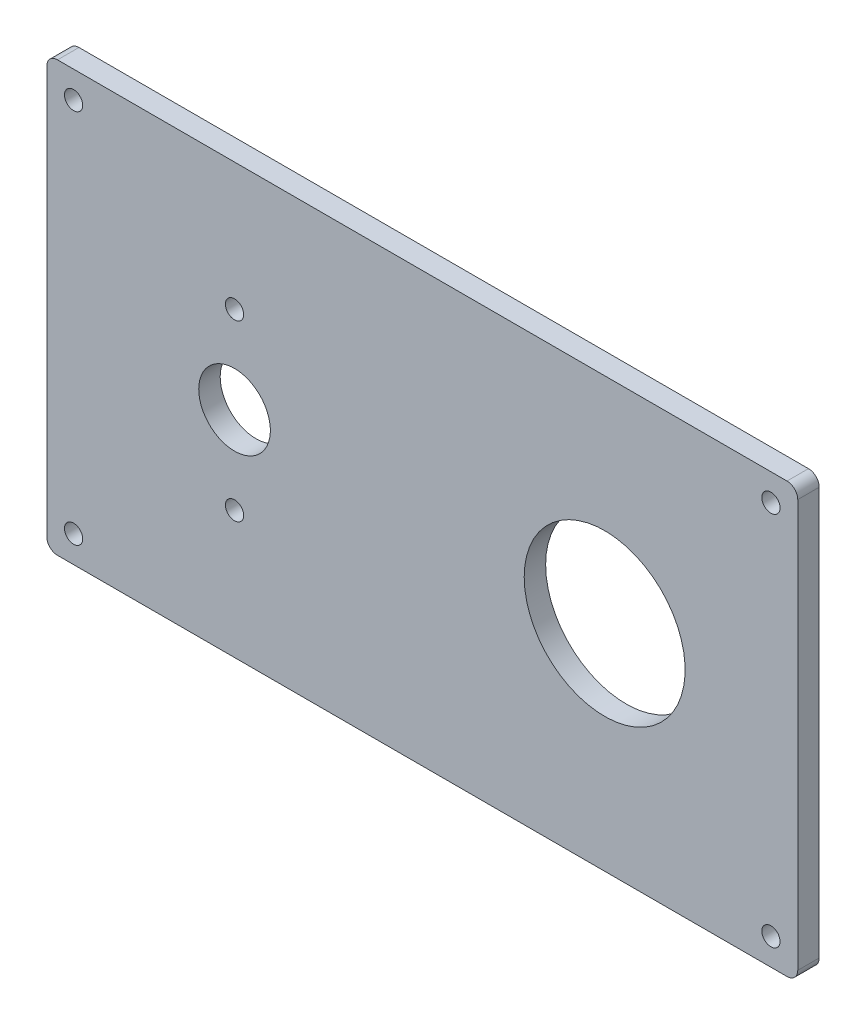
ISO-10303-21;
HEADER;
FILE_DESCRIPTION(('STEP AP214'),'2;1');
FILE_NAME('part.step','',(''),(''),'','','');
FILE_SCHEMA(('AUTOMOTIVE_DESIGN { 1 0 10303 214 1 1 1 1 }'));
ENDSEC;
DATA;
#1=APPLICATION_CONTEXT('core data for automotive mechanical design processes');
#2=APPLICATION_PROTOCOL_DEFINITION('international standard','automotive_design',2000,#1);
#3=PRODUCT_CONTEXT('',#1,'mechanical');
#4=PRODUCT('Part','Part','',(#3));
#5=PRODUCT_RELATED_PRODUCT_CATEGORY('part','',(#4));
#6=PRODUCT_DEFINITION_FORMATION('','',#4);
#7=PRODUCT_DEFINITION_CONTEXT('part definition',#1,'design');
#8=PRODUCT_DEFINITION('design','',#6,#7);
#9=PRODUCT_DEFINITION_SHAPE('','',#8);
#10=(LENGTH_UNIT() NAMED_UNIT(*) SI_UNIT(.MILLI.,.METRE.));
#11=(NAMED_UNIT(*) PLANE_ANGLE_UNIT() SI_UNIT($,.RADIAN.));
#12=(NAMED_UNIT(*) SI_UNIT($,.STERADIAN.) SOLID_ANGLE_UNIT());
#13=UNCERTAINTY_MEASURE_WITH_UNIT(LENGTH_MEASURE(1.E-05),#10,'distance_accuracy_value','');
#14=(GEOMETRIC_REPRESENTATION_CONTEXT(3) GLOBAL_UNCERTAINTY_ASSIGNED_CONTEXT((#13)) GLOBAL_UNIT_ASSIGNED_CONTEXT((#10,
#11,#12)) REPRESENTATION_CONTEXT('',''));
#15=CARTESIAN_POINT('',(0.,0.,0.));
#16=DIRECTION('',(0.,0.,1.));
#17=DIRECTION('',(1.,0.,0.));
#18=AXIS2_PLACEMENT_3D('',#15,#16,#17);
#19=CARTESIAN_POINT('',(-1.10944648153135,38.5388552235937,4.));
#20=DIRECTION('',(1.,0.,0.));
#21=DIRECTION('',(0.,1.,0.));
#22=AXIS2_PLACEMENT_3D('',#19,#20,#21);
#23=PLANE('',#22);
#24=DIRECTION('',(0.,-1.,0.));
#25=VECTOR('',#24,1.);
#26=CARTESIAN_POINT('',(-1.10944648153135,38.5388552235937,0.));
#27=LINE('',#26,#25);
#28=CARTESIAN_POINT('',(-1.10944648153135,36.5388552235937,0.));
#29=VERTEX_POINT('',#28);
#30=CARTESIAN_POINT('',(-1.10944648153134,-39.4611447764063,0.));
#31=VERTEX_POINT('',#30);
#32=EDGE_CURVE('E128',#29,#31,#27,.T.);
#33=ORIENTED_EDGE('',*,*,#32,.T.);
#34=DIRECTION('',(0.,0.,-1.));
#35=VECTOR('',#34,1.);
#36=CARTESIAN_POINT('',(-1.10944648153134,-39.4611447764063,4.));
#37=LINE('',#36,#35);
#38=CARTESIAN_POINT('',(-1.10944648153134,-39.4611447764063,4.));
#39=VERTEX_POINT('',#38);
#40=EDGE_CURVE('E151',#31,#39,#37,.F.);
#41=ORIENTED_EDGE('',*,*,#40,.T.);
#42=DIRECTION('',(0.,-1.,0.));
#43=VECTOR('',#42,1.);
#44=CARTESIAN_POINT('',(-1.10944648153135,38.5388552235937,4.));
#45=LINE('',#44,#43);
#46=CARTESIAN_POINT('',(-1.10944648153135,36.5388552235937,4.));
#47=VERTEX_POINT('',#46);
#48=EDGE_CURVE('E126',#47,#39,#45,.T.);
#49=ORIENTED_EDGE('',*,*,#48,.F.);
#50=DIRECTION('',(0.,0.,-1.));
#51=VECTOR('',#50,1.);
#52=CARTESIAN_POINT('',(-1.10944648153135,36.5388552235937,4.));
#53=LINE('',#52,#51);
#54=EDGE_CURVE('E148',#47,#29,#53,.T.);
#55=ORIENTED_EDGE('',*,*,#54,.T.);
#56=EDGE_LOOP('',(#33,#41,#49,#55));
#57=FACE_BOUND('',#56,.T.);
#58=ADVANCED_FACE('F33',(#57),#23,.F.);
#59=CARTESIAN_POINT('',(-1.10944648153134,-41.4611447764063,4.));
#60=DIRECTION('',(0.,1.,0.));
#61=DIRECTION('',(0.,0.,1.));
#62=AXIS2_PLACEMENT_3D('',#59,#60,#61);
#63=PLANE('',#62);
#64=DIRECTION('',(1.,0.,0.));
#65=VECTOR('',#64,1.);
#66=CARTESIAN_POINT('',(-1.10944648153134,-41.4611447764063,0.));
#67=LINE('',#66,#65);
#68=CARTESIAN_POINT('',(0.890553518468664,-41.4611447764063,0.));
#69=VERTEX_POINT('',#68);
#70=CARTESIAN_POINT('',(136.890553518469,-41.4611447764063,0.));
#71=VERTEX_POINT('',#70);
#72=EDGE_CURVE('E124',#69,#71,#67,.T.);
#73=ORIENTED_EDGE('',*,*,#72,.T.);
#74=DIRECTION('',(0.,0.,-1.));
#75=VECTOR('',#74,1.);
#76=CARTESIAN_POINT('',(136.890553518469,-41.4611447764063,4.));
#77=LINE('',#76,#75);
#78=CARTESIAN_POINT('',(136.890553518469,-41.4611447764063,4.));
#79=VERTEX_POINT('',#78);
#80=EDGE_CURVE('E103',#71,#79,#77,.F.);
#81=ORIENTED_EDGE('',*,*,#80,.T.);
#82=DIRECTION('',(1.,0.,0.));
#83=VECTOR('',#82,1.);
#84=CARTESIAN_POINT('',(-1.10944648153134,-41.4611447764063,4.));
#85=LINE('',#84,#83);
#86=CARTESIAN_POINT('',(0.890553518468664,-41.4611447764063,4.));
#87=VERTEX_POINT('',#86);
#88=EDGE_CURVE('E167',#87,#79,#85,.T.);
#89=ORIENTED_EDGE('',*,*,#88,.F.);
#90=DIRECTION('',(0.,0.,-1.));
#91=VECTOR('',#90,1.);
#92=CARTESIAN_POINT('',(0.890553518468664,-41.4611447764063,4.));
#93=LINE('',#92,#91);
#94=EDGE_CURVE('E108',#87,#69,#93,.T.);
#95=ORIENTED_EDGE('',*,*,#94,.T.);
#96=EDGE_LOOP('',(#73,#81,#89,#95));
#97=FACE_BOUND('',#96,.T.);
#98=ADVANCED_FACE('F259',(#97),#63,.F.);
#99=CARTESIAN_POINT('',(138.890553518469,38.5388552235937,4.));
#100=DIRECTION('',(-1.,0.,0.));
#101=DIRECTION('',(0.,0.,1.));
#102=AXIS2_PLACEMENT_3D('',#99,#100,#101);
#103=PLANE('',#102);
#104=DIRECTION('',(0.,1.,0.));
#105=VECTOR('',#104,1.);
#106=CARTESIAN_POINT('',(138.890553518469,38.5388552235937,4.));
#107=LINE('',#106,#105);
#108=CARTESIAN_POINT('',(138.890553518469,-39.4611447764063,4.));
#109=VERTEX_POINT('',#108);
#110=CARTESIAN_POINT('',(138.890553518469,36.5388552235937,4.));
#111=VERTEX_POINT('',#110);
#112=EDGE_CURVE('E117',#109,#111,#107,.T.);
#113=ORIENTED_EDGE('',*,*,#112,.F.);
#114=DIRECTION('',(0.,0.,-1.));
#115=VECTOR('',#114,1.);
#116=CARTESIAN_POINT('',(138.890553518469,-39.4611447764063,4.));
#117=LINE('',#116,#115);
#118=CARTESIAN_POINT('',(138.890553518469,-39.4611447764063,0.));
#119=VERTEX_POINT('',#118);
#120=EDGE_CURVE('E102',#109,#119,#117,.T.);
#121=ORIENTED_EDGE('',*,*,#120,.T.);
#122=DIRECTION('',(0.,1.,0.));
#123=VECTOR('',#122,1.);
#124=CARTESIAN_POINT('',(138.890553518469,38.5388552235937,0.));
#125=LINE('',#124,#123);
#126=CARTESIAN_POINT('',(138.890553518469,36.5388552235937,0.));
#127=VERTEX_POINT('',#126);
#128=EDGE_CURVE('E115',#119,#127,#125,.T.);
#129=ORIENTED_EDGE('',*,*,#128,.T.);
#130=DIRECTION('',(0.,0.,-1.));
#131=VECTOR('',#130,1.);
#132=CARTESIAN_POINT('',(138.890553518469,36.5388552235937,4.));
#133=LINE('',#132,#131);
#134=EDGE_CURVE('E119',#127,#111,#133,.F.);
#135=ORIENTED_EDGE('',*,*,#134,.T.);
#136=EDGE_LOOP('',(#113,#121,#129,#135));
#137=FACE_BOUND('',#136,.T.);
#138=ADVANCED_FACE('F114',(#137),#103,.F.);
#139=CARTESIAN_POINT('',(-1.10944648153135,38.5388552235937,4.));
#140=DIRECTION('',(0.,-1.,0.));
#141=DIRECTION('',(0.,0.,-1.));
#142=AXIS2_PLACEMENT_3D('',#139,#140,#141);
#143=PLANE('',#142);
#144=DIRECTION('',(-1.,0.,0.));
#145=VECTOR('',#144,1.);
#146=CARTESIAN_POINT('',(-1.10944648153135,38.5388552235937,0.));
#147=LINE('',#146,#145);
#148=CARTESIAN_POINT('',(136.890553518469,38.5388552235937,0.));
#149=VERTEX_POINT('',#148);
#150=CARTESIAN_POINT('',(0.890553518468655,38.5388552235937,0.));
#151=VERTEX_POINT('',#150);
#152=EDGE_CURVE('E123',#149,#151,#147,.T.);
#153=ORIENTED_EDGE('',*,*,#152,.T.);
#154=DIRECTION('',(0.,0.,-1.));
#155=VECTOR('',#154,1.);
#156=CARTESIAN_POINT('',(0.890553518468655,38.5388552235937,4.));
#157=LINE('',#156,#155);
#158=CARTESIAN_POINT('',(0.890553518468655,38.5388552235937,4.));
#159=VERTEX_POINT('',#158);
#160=EDGE_CURVE('E11',#151,#159,#157,.F.);
#161=ORIENTED_EDGE('',*,*,#160,.T.);
#162=DIRECTION('',(-1.,0.,0.));
#163=VECTOR('',#162,1.);
#164=CARTESIAN_POINT('',(-1.10944648153135,38.5388552235937,4.));
#165=LINE('',#164,#163);
#166=CARTESIAN_POINT('',(136.890553518469,38.5388552235937,4.));
#167=VERTEX_POINT('',#166);
#168=EDGE_CURVE('E132',#167,#159,#165,.T.);
#169=ORIENTED_EDGE('',*,*,#168,.F.);
#170=DIRECTION('',(0.,0.,-1.));
#171=VECTOR('',#170,1.);
#172=CARTESIAN_POINT('',(136.890553518469,38.5388552235937,4.));
#173=LINE('',#172,#171);
#174=EDGE_CURVE('E41',#167,#149,#173,.T.);
#175=ORIENTED_EDGE('',*,*,#174,.T.);
#176=EDGE_LOOP('',(#153,#161,#169,#175));
#177=FACE_BOUND('',#176,.T.);
#178=ADVANCED_FACE('F154',(#177),#143,.F.);
#179=CARTESIAN_POINT('',(0.,0.,4.));
#180=DIRECTION('',(0.,0.,1.));
#181=DIRECTION('',(1.,0.,0.));
#182=AXIS2_PLACEMENT_3D('',#179,#180,#181);
#183=PLANE('',#182);
#184=CARTESIAN_POINT('',(33.8905535184687,14.7588552235937,4.));
#185=DIRECTION('',(0.,0.,-1.));
#186=DIRECTION('',(-1.,0.,0.));
#187=AXIS2_PLACEMENT_3D('',#184,#185,#186);
#188=CIRCLE('',#187,1.7);
#189=CARTESIAN_POINT('',(32.1905535184687,14.7588552235937,4.));
#190=VERTEX_POINT('',#189);
#191=EDGE_CURVE('E181',#190,#190,#188,.T.);
#192=ORIENTED_EDGE('',*,*,#191,.T.);
#193=EDGE_LOOP('',(#192));
#194=FACE_BOUND('',#193,.T.);
#195=CARTESIAN_POINT('',(33.8905535184687,-17.6811447764063,4.));
#196=DIRECTION('',(0.,0.,-1.));
#197=DIRECTION('',(-1.,0.,0.));
#198=AXIS2_PLACEMENT_3D('',#195,#196,#197);
#199=CIRCLE('',#198,1.7);
#200=CARTESIAN_POINT('',(32.1905535184687,-17.6811447764063,4.));
#201=VERTEX_POINT('',#200);
#202=EDGE_CURVE('E199',#201,#201,#199,.T.);
#203=ORIENTED_EDGE('',*,*,#202,.T.);
#204=EDGE_LOOP('',(#203));
#205=FACE_BOUND('',#204,.T.);
#206=CARTESIAN_POINT('',(3.89055351846866,-36.4611447764063,4.));
#207=DIRECTION('',(0.,0.,-1.));
#208=DIRECTION('',(-1.,0.,0.));
#209=AXIS2_PLACEMENT_3D('',#206,#207,#208);
#210=CIRCLE('',#209,1.7);
#211=CARTESIAN_POINT('',(2.19055351846866,-36.4611447764063,4.));
#212=VERTEX_POINT('',#211);
#213=EDGE_CURVE('E193',#212,#212,#210,.T.);
#214=ORIENTED_EDGE('',*,*,#213,.T.);
#215=EDGE_LOOP('',(#214));
#216=FACE_BOUND('',#215,.T.);
#217=CARTESIAN_POINT('',(133.890553518469,-36.4611447764063,4.));
#218=DIRECTION('',(0.,0.,-1.));
#219=DIRECTION('',(-1.,0.,0.));
#220=AXIS2_PLACEMENT_3D('',#217,#218,#219);
#221=CIRCLE('',#220,1.70000000000001);
#222=CARTESIAN_POINT('',(132.190553518469,-36.4611447764063,4.));
#223=VERTEX_POINT('',#222);
#224=EDGE_CURVE('E186',#223,#223,#221,.T.);
#225=ORIENTED_EDGE('',*,*,#224,.T.);
#226=EDGE_LOOP('',(#225));
#227=FACE_BOUND('',#226,.T.);
#228=CARTESIAN_POINT('',(133.890553518469,33.5388552235937,4.));
#229=DIRECTION('',(0.,0.,-1.));
#230=DIRECTION('',(-1.,0.,0.));
#231=AXIS2_PLACEMENT_3D('',#228,#229,#230);
#232=CIRCLE('',#231,1.70000000000001);
#233=CARTESIAN_POINT('',(132.190553518469,33.5388552235937,4.));
#234=VERTEX_POINT('',#233);
#235=EDGE_CURVE('E187',#234,#234,#232,.T.);
#236=ORIENTED_EDGE('',*,*,#235,.T.);
#237=EDGE_LOOP('',(#236));
#238=FACE_BOUND('',#237,.T.);
#239=CARTESIAN_POINT('',(3.89055351846865,33.5388552235937,4.));
#240=DIRECTION('',(0.,0.,-1.));
#241=DIRECTION('',(-1.,0.,0.));
#242=AXIS2_PLACEMENT_3D('',#239,#240,#241);
#243=CIRCLE('',#242,1.70000000000002);
#244=CARTESIAN_POINT('',(2.19055351846864,33.5388552235937,4.));
#245=VERTEX_POINT('',#244);
#246=EDGE_CURVE('E216',#245,#245,#243,.T.);
#247=ORIENTED_EDGE('',*,*,#246,.T.);
#248=EDGE_LOOP('',(#247));
#249=FACE_BOUND('',#248,.T.);
#250=CARTESIAN_POINT('',(102.890553518469,-1.46114477640628,4.));
#251=DIRECTION('',(0.,0.,-1.));
#252=DIRECTION('',(-1.,0.,0.));
#253=AXIS2_PLACEMENT_3D('',#250,#251,#252);
#254=CIRCLE('',#253,15.);
#255=CARTESIAN_POINT('',(87.8905535184686,-1.46114477640628,4.));
#256=VERTEX_POINT('',#255);
#257=EDGE_CURVE('E210',#256,#256,#254,.T.);
#258=ORIENTED_EDGE('',*,*,#257,.T.);
#259=EDGE_LOOP('',(#258));
#260=FACE_BOUND('',#259,.T.);
#261=CARTESIAN_POINT('',(33.8905535184687,-1.46114477640628,4.));
#262=DIRECTION('',(0.,0.,-1.));
#263=DIRECTION('',(-1.,0.,0.));
#264=AXIS2_PLACEMENT_3D('',#261,#262,#263);
#265=CIRCLE('',#264,6.675);
#266=CARTESIAN_POINT('',(27.2155535184687,-1.46114477640628,4.));
#267=VERTEX_POINT('',#266);
#268=EDGE_CURVE('E176',#267,#267,#265,.T.);
#269=ORIENTED_EDGE('',*,*,#268,.T.);
#270=EDGE_LOOP('',(#269));
#271=FACE_BOUND('',#270,.T.);
#272=ORIENTED_EDGE('',*,*,#88,.T.);
#273=CARTESIAN_POINT('',(136.890553518469,-39.4611447764063,4.));
#274=DIRECTION('',(0.,0.,1.));
#275=DIRECTION('',(1.,0.,0.));
#276=AXIS2_PLACEMENT_3D('',#273,#274,#275);
#277=CIRCLE('',#276,2.);
#278=EDGE_CURVE('E146',#79,#109,#277,.T.);
#279=ORIENTED_EDGE('',*,*,#278,.T.);
#280=ORIENTED_EDGE('',*,*,#112,.T.);
#281=CARTESIAN_POINT('',(136.890553518469,36.5388552235937,4.));
#282=DIRECTION('',(0.,0.,1.));
#283=DIRECTION('',(1.,0.,0.));
#284=AXIS2_PLACEMENT_3D('',#281,#282,#283);
#285=CIRCLE('',#284,2.);
#286=EDGE_CURVE('E53',#111,#167,#285,.T.);
#287=ORIENTED_EDGE('',*,*,#286,.T.);
#288=ORIENTED_EDGE('',*,*,#168,.T.);
#289=CARTESIAN_POINT('',(0.890553518468655,36.5388552235937,4.));
#290=DIRECTION('',(0.,0.,1.));
#291=DIRECTION('',(1.,0.,0.));
#292=AXIS2_PLACEMENT_3D('',#289,#290,#291);
#293=CIRCLE('',#292,2.);
#294=EDGE_CURVE('E142',#159,#47,#293,.T.);
#295=ORIENTED_EDGE('',*,*,#294,.T.);
#296=ORIENTED_EDGE('',*,*,#48,.T.);
#297=CARTESIAN_POINT('',(0.890553518468664,-39.4611447764063,4.));
#298=DIRECTION('',(0.,0.,1.));
#299=DIRECTION('',(1.,0.,0.));
#300=AXIS2_PLACEMENT_3D('',#297,#298,#299);
#301=CIRCLE('',#300,2.);
#302=EDGE_CURVE('E144',#39,#87,#301,.T.);
#303=ORIENTED_EDGE('',*,*,#302,.T.);
#304=EDGE_LOOP('',(#272,#279,#280,#287,#288,#295,#296,#303));
#305=FACE_BOUND('',#304,.T.);
#306=ADVANCED_FACE('F225',(#194,#205,#216,#227,#238,#249,#260,#271,#305),#183,.T.);
#307=CARTESIAN_POINT('',(0.,0.,0.));
#308=DIRECTION('',(0.,0.,1.));
#309=DIRECTION('',(1.,0.,0.));
#310=AXIS2_PLACEMENT_3D('',#307,#308,#309);
#311=PLANE('',#310);
#312=CARTESIAN_POINT('',(33.8905535184687,14.7588552235937,0.));
#313=DIRECTION('',(0.,0.,-1.));
#314=DIRECTION('',(-1.,0.,0.));
#315=AXIS2_PLACEMENT_3D('',#312,#313,#314);
#316=CIRCLE('',#315,1.7);
#317=CARTESIAN_POINT('',(32.1905535184687,14.7588552235937,0.));
#318=VERTEX_POINT('',#317);
#319=EDGE_CURVE('E202',#318,#318,#316,.T.);
#320=ORIENTED_EDGE('',*,*,#319,.F.);
#321=EDGE_LOOP('',(#320));
#322=FACE_BOUND('',#321,.T.);
#323=CARTESIAN_POINT('',(33.8905535184687,-17.6811447764063,0.));
#324=DIRECTION('',(0.,0.,-1.));
#325=DIRECTION('',(-1.,0.,0.));
#326=AXIS2_PLACEMENT_3D('',#323,#324,#325);
#327=CIRCLE('',#326,1.7);
#328=CARTESIAN_POINT('',(32.1905535184687,-17.6811447764063,0.));
#329=VERTEX_POINT('',#328);
#330=EDGE_CURVE('E196',#329,#329,#327,.T.);
#331=ORIENTED_EDGE('',*,*,#330,.F.);
#332=EDGE_LOOP('',(#331));
#333=FACE_BOUND('',#332,.T.);
#334=CARTESIAN_POINT('',(3.89055351846866,-36.4611447764063,0.));
#335=DIRECTION('',(0.,0.,-1.));
#336=DIRECTION('',(-1.,0.,0.));
#337=AXIS2_PLACEMENT_3D('',#334,#335,#336);
#338=CIRCLE('',#337,1.7);
#339=CARTESIAN_POINT('',(2.19055351846866,-36.4611447764063,0.));
#340=VERTEX_POINT('',#339);
#341=EDGE_CURVE('E190',#340,#340,#338,.T.);
#342=ORIENTED_EDGE('',*,*,#341,.F.);
#343=EDGE_LOOP('',(#342));
#344=FACE_BOUND('',#343,.T.);
#345=CARTESIAN_POINT('',(133.890553518469,-36.4611447764063,0.));
#346=DIRECTION('',(0.,0.,-1.));
#347=DIRECTION('',(-1.,0.,0.));
#348=AXIS2_PLACEMENT_3D('',#345,#346,#347);
#349=CIRCLE('',#348,1.70000000000001);
#350=CARTESIAN_POINT('',(132.190553518469,-36.4611447764063,0.));
#351=VERTEX_POINT('',#350);
#352=EDGE_CURVE('E183',#351,#351,#349,.T.);
#353=ORIENTED_EDGE('',*,*,#352,.F.);
#354=EDGE_LOOP('',(#353));
#355=FACE_BOUND('',#354,.T.);
#356=CARTESIAN_POINT('',(133.890553518469,33.5388552235937,0.));
#357=DIRECTION('',(0.,0.,-1.));
#358=DIRECTION('',(-1.,0.,0.));
#359=AXIS2_PLACEMENT_3D('',#356,#357,#358);
#360=CIRCLE('',#359,1.70000000000001);
#361=CARTESIAN_POINT('',(132.190553518469,33.5388552235937,0.));
#362=VERTEX_POINT('',#361);
#363=EDGE_CURVE('E219',#362,#362,#360,.T.);
#364=ORIENTED_EDGE('',*,*,#363,.F.);
#365=EDGE_LOOP('',(#364));
#366=FACE_BOUND('',#365,.T.);
#367=CARTESIAN_POINT('',(3.89055351846865,33.5388552235937,0.));
#368=DIRECTION('',(0.,0.,-1.));
#369=DIRECTION('',(-1.,0.,0.));
#370=AXIS2_PLACEMENT_3D('',#367,#368,#369);
#371=CIRCLE('',#370,1.70000000000002);
#372=CARTESIAN_POINT('',(2.19055351846864,33.5388552235937,0.));
#373=VERTEX_POINT('',#372);
#374=EDGE_CURVE('E213',#373,#373,#371,.T.);
#375=ORIENTED_EDGE('',*,*,#374,.F.);
#376=EDGE_LOOP('',(#375));
#377=FACE_BOUND('',#376,.T.);
#378=CARTESIAN_POINT('',(102.890553518469,-1.46114477640628,0.));
#379=DIRECTION('',(0.,0.,-1.));
#380=DIRECTION('',(-1.,0.,0.));
#381=AXIS2_PLACEMENT_3D('',#378,#379,#380);
#382=CIRCLE('',#381,15.);
#383=CARTESIAN_POINT('',(87.8905535184686,-1.46114477640628,0.));
#384=VERTEX_POINT('',#383);
#385=EDGE_CURVE('E207',#384,#384,#382,.T.);
#386=ORIENTED_EDGE('',*,*,#385,.F.);
#387=EDGE_LOOP('',(#386));
#388=FACE_BOUND('',#387,.T.);
#389=CARTESIAN_POINT('',(33.8905535184687,-1.46114477640628,0.));
#390=DIRECTION('',(0.,0.,-1.));
#391=DIRECTION('',(-1.,0.,0.));
#392=AXIS2_PLACEMENT_3D('',#389,#390,#391);
#393=CIRCLE('',#392,6.675);
#394=CARTESIAN_POINT('',(27.2155535184687,-1.46114477640628,0.));
#395=VERTEX_POINT('',#394);
#396=EDGE_CURVE('E172',#395,#395,#393,.T.);
#397=ORIENTED_EDGE('',*,*,#396,.F.);
#398=EDGE_LOOP('',(#397));
#399=FACE_BOUND('',#398,.T.);
#400=ORIENTED_EDGE('',*,*,#128,.F.);
#401=CARTESIAN_POINT('',(136.890553518469,-39.4611447764063,0.));
#402=DIRECTION('',(0.,0.,1.));
#403=DIRECTION('',(1.,0.,0.));
#404=AXIS2_PLACEMENT_3D('',#401,#402,#403);
#405=CIRCLE('',#404,2.);
#406=EDGE_CURVE('E98',#119,#71,#405,.F.);
#407=ORIENTED_EDGE('',*,*,#406,.T.);
#408=ORIENTED_EDGE('',*,*,#72,.F.);
#409=CARTESIAN_POINT('',(0.890553518468664,-39.4611447764063,0.));
#410=DIRECTION('',(0.,0.,1.));
#411=DIRECTION('',(1.,0.,0.));
#412=AXIS2_PLACEMENT_3D('',#409,#410,#411);
#413=CIRCLE('',#412,2.);
#414=EDGE_CURVE('E109',#69,#31,#413,.F.);
#415=ORIENTED_EDGE('',*,*,#414,.T.);
#416=ORIENTED_EDGE('',*,*,#32,.F.);
#417=CARTESIAN_POINT('',(0.890553518468655,36.5388552235937,0.));
#418=DIRECTION('',(0.,0.,1.));
#419=DIRECTION('',(1.,0.,0.));
#420=AXIS2_PLACEMENT_3D('',#417,#418,#419);
#421=CIRCLE('',#420,2.);
#422=EDGE_CURVE('E135',#29,#151,#421,.F.);
#423=ORIENTED_EDGE('',*,*,#422,.T.);
#424=ORIENTED_EDGE('',*,*,#152,.F.);
#425=CARTESIAN_POINT('',(136.890553518469,36.5388552235937,0.));
#426=DIRECTION('',(0.,0.,1.));
#427=DIRECTION('',(1.,0.,0.));
#428=AXIS2_PLACEMENT_3D('',#425,#426,#427);
#429=CIRCLE('',#428,2.);
#430=EDGE_CURVE('E118',#149,#127,#429,.F.);
#431=ORIENTED_EDGE('',*,*,#430,.T.);
#432=EDGE_LOOP('',(#400,#407,#408,#415,#416,#423,#424,#431));
#433=FACE_BOUND('',#432,.T.);
#434=ADVANCED_FACE('F121',(#322,#333,#344,#355,#366,#377,#388,#399,#433),#311,.F.);
#435=CARTESIAN_POINT('',(33.8905535184687,-1.46114477640628,4.));
#436=DIRECTION('',(0.,0.,-1.));
#437=DIRECTION('',(-1.,0.,0.));
#438=AXIS2_PLACEMENT_3D('',#435,#436,#437);
#439=CYLINDRICAL_SURFACE('',#438,6.675);
#440=ORIENTED_EDGE('',*,*,#268,.F.);
#441=EDGE_LOOP('',(#440));
#442=FACE_BOUND('',#441,.T.);
#443=ORIENTED_EDGE('',*,*,#396,.T.);
#444=EDGE_LOOP('',(#443));
#445=FACE_BOUND('',#444,.T.);
#446=ADVANCED_FACE('F238',(#442,#445),#439,.F.);
#447=CARTESIAN_POINT('',(102.890553518469,-1.46114477640628,4.));
#448=DIRECTION('',(0.,0.,-1.));
#449=DIRECTION('',(-1.,0.,0.));
#450=AXIS2_PLACEMENT_3D('',#447,#448,#449);
#451=CYLINDRICAL_SURFACE('',#450,15.);
#452=ORIENTED_EDGE('',*,*,#257,.F.);
#453=EDGE_LOOP('',(#452));
#454=FACE_BOUND('',#453,.T.);
#455=ORIENTED_EDGE('',*,*,#385,.T.);
#456=EDGE_LOOP('',(#455));
#457=FACE_BOUND('',#456,.T.);
#458=ADVANCED_FACE('F248',(#454,#457),#451,.F.);
#459=CARTESIAN_POINT('',(3.89055351846865,33.5388552235937,4.));
#460=DIRECTION('',(0.,0.,-1.));
#461=DIRECTION('',(-1.,0.,0.));
#462=AXIS2_PLACEMENT_3D('',#459,#460,#461);
#463=CYLINDRICAL_SURFACE('',#462,1.70000000000002);
#464=ORIENTED_EDGE('',*,*,#246,.F.);
#465=EDGE_LOOP('',(#464));
#466=FACE_BOUND('',#465,.T.);
#467=ORIENTED_EDGE('',*,*,#374,.T.);
#468=EDGE_LOOP('',(#467));
#469=FACE_BOUND('',#468,.T.);
#470=ADVANCED_FACE('F232',(#466,#469),#463,.F.);
#471=CARTESIAN_POINT('',(133.890553518469,33.5388552235937,4.));
#472=DIRECTION('',(0.,0.,-1.));
#473=DIRECTION('',(-1.,0.,0.));
#474=AXIS2_PLACEMENT_3D('',#471,#472,#473);
#475=CYLINDRICAL_SURFACE('',#474,1.70000000000001);
#476=ORIENTED_EDGE('',*,*,#235,.F.);
#477=EDGE_LOOP('',(#476));
#478=FACE_BOUND('',#477,.T.);
#479=ORIENTED_EDGE('',*,*,#363,.T.);
#480=EDGE_LOOP('',(#479));
#481=FACE_BOUND('',#480,.T.);
#482=ADVANCED_FACE('F228',(#478,#481),#475,.F.);
#483=CARTESIAN_POINT('',(133.890553518469,-36.4611447764063,4.));
#484=DIRECTION('',(0.,0.,-1.));
#485=DIRECTION('',(-1.,0.,0.));
#486=AXIS2_PLACEMENT_3D('',#483,#484,#485);
#487=CYLINDRICAL_SURFACE('',#486,1.70000000000001);
#488=ORIENTED_EDGE('',*,*,#224,.F.);
#489=EDGE_LOOP('',(#488));
#490=FACE_BOUND('',#489,.T.);
#491=ORIENTED_EDGE('',*,*,#352,.T.);
#492=EDGE_LOOP('',(#491));
#493=FACE_BOUND('',#492,.T.);
#494=ADVANCED_FACE('F231',(#490,#493),#487,.F.);
#495=CARTESIAN_POINT('',(3.89055351846866,-36.4611447764063,4.));
#496=DIRECTION('',(0.,0.,-1.));
#497=DIRECTION('',(-1.,0.,0.));
#498=AXIS2_PLACEMENT_3D('',#495,#496,#497);
#499=CYLINDRICAL_SURFACE('',#498,1.7);
#500=ORIENTED_EDGE('',*,*,#213,.F.);
#501=EDGE_LOOP('',(#500));
#502=FACE_BOUND('',#501,.T.);
#503=ORIENTED_EDGE('',*,*,#341,.T.);
#504=EDGE_LOOP('',(#503));
#505=FACE_BOUND('',#504,.T.);
#506=ADVANCED_FACE('F345',(#502,#505),#499,.F.);
#507=CARTESIAN_POINT('',(33.8905535184687,-17.6811447764063,4.));
#508=DIRECTION('',(0.,0.,-1.));
#509=DIRECTION('',(-1.,0.,0.));
#510=AXIS2_PLACEMENT_3D('',#507,#508,#509);
#511=CYLINDRICAL_SURFACE('',#510,1.7);
#512=ORIENTED_EDGE('',*,*,#202,.F.);
#513=EDGE_LOOP('',(#512));
#514=FACE_BOUND('',#513,.T.);
#515=ORIENTED_EDGE('',*,*,#330,.T.);
#516=EDGE_LOOP('',(#515));
#517=FACE_BOUND('',#516,.T.);
#518=ADVANCED_FACE('F338',(#514,#517),#511,.F.);
#519=CARTESIAN_POINT('',(33.8905535184687,14.7588552235937,4.));
#520=DIRECTION('',(0.,0.,-1.));
#521=DIRECTION('',(-1.,0.,0.));
#522=AXIS2_PLACEMENT_3D('',#519,#520,#521);
#523=CYLINDRICAL_SURFACE('',#522,1.7);
#524=ORIENTED_EDGE('',*,*,#191,.F.);
#525=EDGE_LOOP('',(#524));
#526=FACE_BOUND('',#525,.T.);
#527=ORIENTED_EDGE('',*,*,#319,.T.);
#528=EDGE_LOOP('',(#527));
#529=FACE_BOUND('',#528,.T.);
#530=ADVANCED_FACE('F271',(#526,#529),#523,.F.);
#531=CARTESIAN_POINT('',(136.890553518469,-39.4611447764063,4.));
#532=DIRECTION('',(0.,0.,-1.));
#533=DIRECTION('',(-1.,0.,0.));
#534=AXIS2_PLACEMENT_3D('',#531,#532,#533);
#535=CYLINDRICAL_SURFACE('',#534,2.);
#536=ORIENTED_EDGE('',*,*,#278,.F.);
#537=ORIENTED_EDGE('',*,*,#80,.F.);
#538=ORIENTED_EDGE('',*,*,#406,.F.);
#539=ORIENTED_EDGE('',*,*,#120,.F.);
#540=EDGE_LOOP('',(#536,#537,#538,#539));
#541=FACE_BOUND('',#540,.T.);
#542=ADVANCED_FACE('F101',(#541),#535,.T.);
#543=CARTESIAN_POINT('',(0.890553518468664,-39.4611447764063,4.));
#544=DIRECTION('',(0.,0.,-1.));
#545=DIRECTION('',(-1.,0.,0.));
#546=AXIS2_PLACEMENT_3D('',#543,#544,#545);
#547=CYLINDRICAL_SURFACE('',#546,2.);
#548=ORIENTED_EDGE('',*,*,#302,.F.);
#549=ORIENTED_EDGE('',*,*,#40,.F.);
#550=ORIENTED_EDGE('',*,*,#414,.F.);
#551=ORIENTED_EDGE('',*,*,#94,.F.);
#552=EDGE_LOOP('',(#548,#549,#550,#551));
#553=FACE_BOUND('',#552,.T.);
#554=ADVANCED_FACE('F270',(#553),#547,.T.);
#555=CARTESIAN_POINT('',(0.890553518468655,36.5388552235937,4.));
#556=DIRECTION('',(0.,0.,-1.));
#557=DIRECTION('',(-1.,0.,0.));
#558=AXIS2_PLACEMENT_3D('',#555,#556,#557);
#559=CYLINDRICAL_SURFACE('',#558,2.);
#560=ORIENTED_EDGE('',*,*,#294,.F.);
#561=ORIENTED_EDGE('',*,*,#160,.F.);
#562=ORIENTED_EDGE('',*,*,#422,.F.);
#563=ORIENTED_EDGE('',*,*,#54,.F.);
#564=EDGE_LOOP('',(#560,#561,#562,#563));
#565=FACE_BOUND('',#564,.T.);
#566=ADVANCED_FACE('F161',(#565),#559,.T.);
#567=CARTESIAN_POINT('',(136.890553518469,36.5388552235937,4.));
#568=DIRECTION('',(0.,0.,-1.));
#569=DIRECTION('',(-1.,0.,0.));
#570=AXIS2_PLACEMENT_3D('',#567,#568,#569);
#571=CYLINDRICAL_SURFACE('',#570,2.);
#572=ORIENTED_EDGE('',*,*,#286,.F.);
#573=ORIENTED_EDGE('',*,*,#134,.F.);
#574=ORIENTED_EDGE('',*,*,#430,.F.);
#575=ORIENTED_EDGE('',*,*,#174,.F.);
#576=EDGE_LOOP('',(#572,#573,#574,#575));
#577=FACE_BOUND('',#576,.T.);
#578=ADVANCED_FACE('F35',(#577),#571,.T.);
#579=CLOSED_SHELL('',(#58,#98,#138,#178,#306,#434,#446,#458,#470,#482,#494,#506,#518,#530,#542,
#554,#566,#578));
#580=MANIFOLD_SOLID_BREP('B2',#579);
#581=ADVANCED_BREP_SHAPE_REPRESENTATION('',(#18,#580),#14);
#582=SHAPE_DEFINITION_REPRESENTATION(#9,#581);
ENDSEC;
END-ISO-10303-21;
